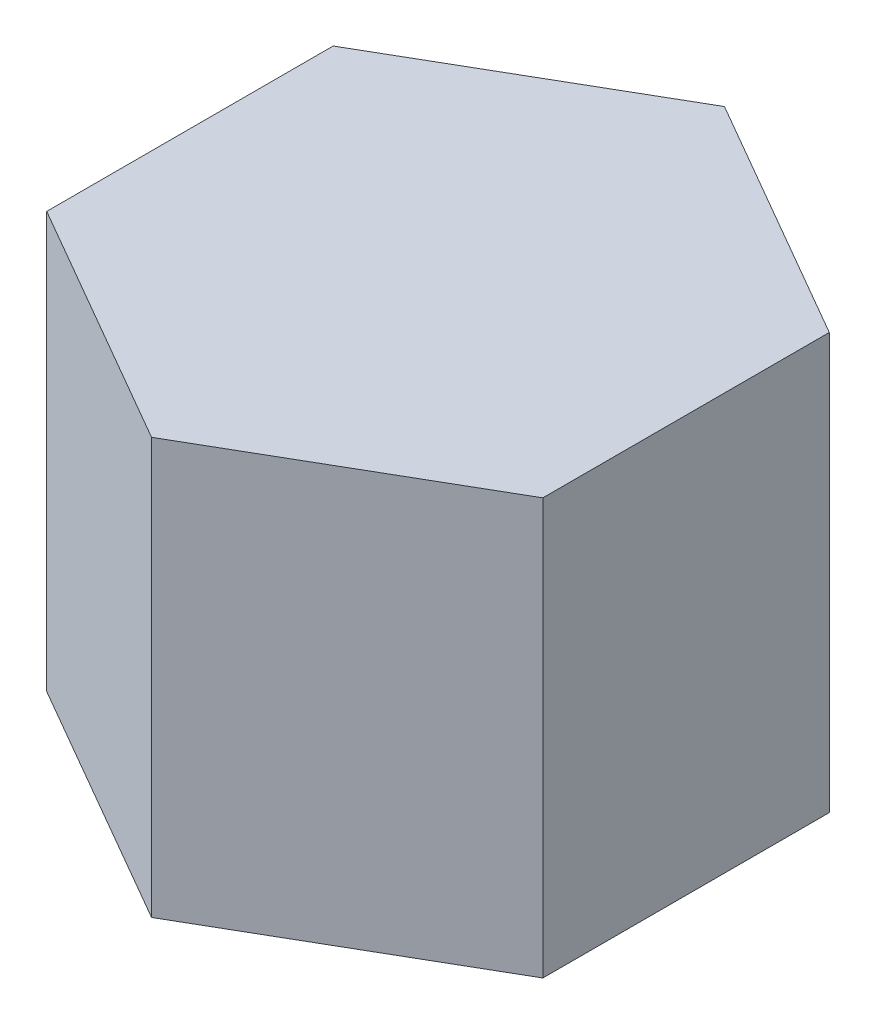
ISO-10303-21;
HEADER;
FILE_DESCRIPTION(('STEP AP214'),'2;1');
FILE_NAME('part.step','',(''),(''),'','','');
FILE_SCHEMA(('AUTOMOTIVE_DESIGN { 1 0 10303 214 1 1 1 1 }'));
ENDSEC;
DATA;
#1=APPLICATION_CONTEXT('core data for automotive mechanical design processes');
#2=APPLICATION_PROTOCOL_DEFINITION('international standard','automotive_design',2000,#1);
#3=PRODUCT_CONTEXT('',#1,'mechanical');
#4=PRODUCT('Part','Part','',(#3));
#5=PRODUCT_RELATED_PRODUCT_CATEGORY('part','',(#4));
#6=PRODUCT_DEFINITION_FORMATION('','',#4);
#7=PRODUCT_DEFINITION_CONTEXT('part definition',#1,'design');
#8=PRODUCT_DEFINITION('design','',#6,#7);
#9=PRODUCT_DEFINITION_SHAPE('','',#8);
#10=(LENGTH_UNIT() NAMED_UNIT(*) SI_UNIT(.MILLI.,.METRE.));
#11=(NAMED_UNIT(*) PLANE_ANGLE_UNIT() SI_UNIT($,.RADIAN.));
#12=(NAMED_UNIT(*) SI_UNIT($,.STERADIAN.) SOLID_ANGLE_UNIT());
#13=UNCERTAINTY_MEASURE_WITH_UNIT(LENGTH_MEASURE(1.E-05),#10,'distance_accuracy_value','');
#14=(GEOMETRIC_REPRESENTATION_CONTEXT(3) GLOBAL_UNCERTAINTY_ASSIGNED_CONTEXT((#13)) GLOBAL_UNIT_ASSIGNED_CONTEXT((#10,
#11,#12)) REPRESENTATION_CONTEXT('',''));
#15=CARTESIAN_POINT('',(0.,0.,0.));
#16=DIRECTION('',(0.,0.,1.));
#17=DIRECTION('',(1.,0.,0.));
#18=AXIS2_PLACEMENT_3D('',#15,#16,#17);
#19=CARTESIAN_POINT('',(209.642660308706,-148.537700895744,294.971072835632));
#20=DIRECTION('',(-0.499999999999909,0.,-0.866025403784491));
#21=DIRECTION('',(-0.866025403784491,0.,0.499999999999909));
#22=AXIS2_PLACEMENT_3D('',#19,#20,#21);
#23=PLANE('',#22);
#24=CARTESIAN_POINT('',(209.339551417381,-149.045793579175,295.146072835632));
#25=DIRECTION('',(0.866025403784491,0.,-0.499999999999909));
#26=VECTOR('',#25,1.);
#27=LINE('',#24,#26);
#28=CARTESIAN_POINT('',(209.339551417382,-149.045793579175,295.146072835632));
#29=VERTEX_POINT('',#28);
#30=CARTESIAN_POINT('',(209.642660308706,-149.045793579175,294.971072835632));
#31=VERTEX_POINT('',#30);
#32=EDGE_CURVE('E170',#29,#31,#27,.T.);
#33=ORIENTED_EDGE('',*,*,#32,.T.);
#34=CARTESIAN_POINT('',(209.642660308706,-148.537700895744,294.971072835632));
#35=DIRECTION('',(0.,-1.,0.));
#36=VECTOR('',#35,1.);
#37=LINE('',#34,#36);
#38=CARTESIAN_POINT('',(209.642660308706,-148.537700895744,294.971072835632));
#39=VERTEX_POINT('',#38);
#40=EDGE_CURVE('E35',#39,#31,#37,.T.);
#41=ORIENTED_EDGE('',*,*,#40,.F.);
#42=CARTESIAN_POINT('',(209.339551417381,-148.537700895744,295.146072835632));
#43=DIRECTION('',(0.866025403784491,0.,-0.499999999999909));
#44=VECTOR('',#43,1.);
#45=LINE('',#42,#44);
#46=CARTESIAN_POINT('',(209.339551417382,-148.537700895744,295.146072835632));
#47=VERTEX_POINT('',#46);
#48=EDGE_CURVE('E159',#47,#39,#45,.T.);
#49=ORIENTED_EDGE('',*,*,#48,.F.);
#50=CARTESIAN_POINT('',(209.339551417381,-148.537700895744,295.146072835632));
#51=DIRECTION('',(0.,-1.,0.));
#52=VECTOR('',#51,1.);
#53=LINE('',#50,#52);
#54=EDGE_CURVE('E10',#47,#29,#53,.T.);
#55=ORIENTED_EDGE('',*,*,#54,.T.);
#56=EDGE_LOOP('',(#33,#41,#49,#55));
#57=FACE_BOUND('',#56,.T.);
#58=ADVANCED_FACE('F16',(#57),#23,.F.);
#59=CARTESIAN_POINT('',(209.339551417382,-148.537700895744,295.146072835632));
#60=DIRECTION('',(0.500000000000062,0.,-0.866025403784403));
#61=DIRECTION('',(-0.866025403784403,0.,-0.500000000000062));
#62=AXIS2_PLACEMENT_3D('',#59,#60,#61);
#63=PLANE('',#62);
#64=CARTESIAN_POINT('',(209.036442526057,-149.045793579175,294.971072835632));
#65=DIRECTION('',(0.866025403784403,0.,0.500000000000062));
#66=VECTOR('',#65,1.);
#67=LINE('',#64,#66);
#68=CARTESIAN_POINT('',(209.036442526057,-149.045793579175,294.971072835632));
#69=VERTEX_POINT('',#68);
#70=EDGE_CURVE('E167',#69,#29,#67,.T.);
#71=ORIENTED_EDGE('',*,*,#70,.T.);
#72=ORIENTED_EDGE('',*,*,#54,.F.);
#73=CARTESIAN_POINT('',(209.036442526057,-148.537700895744,294.971072835632));
#74=DIRECTION('',(0.866025403784403,0.,0.500000000000062));
#75=VECTOR('',#74,1.);
#76=LINE('',#73,#75);
#77=CARTESIAN_POINT('',(209.036442526057,-148.537700895744,294.971072835632));
#78=VERTEX_POINT('',#77);
#79=EDGE_CURVE('E156',#78,#47,#76,.T.);
#80=ORIENTED_EDGE('',*,*,#79,.F.);
#81=CARTESIAN_POINT('',(209.036442526057,-148.537700895744,294.971072835632));
#82=DIRECTION('',(0.,-1.,0.));
#83=VECTOR('',#82,1.);
#84=LINE('',#81,#83);
#85=EDGE_CURVE('E27',#78,#69,#84,.T.);
#86=ORIENTED_EDGE('',*,*,#85,.T.);
#87=EDGE_LOOP('',(#71,#72,#80,#86));
#88=FACE_BOUND('',#87,.T.);
#89=ADVANCED_FACE('F189',(#88),#63,.F.);
#90=CARTESIAN_POINT('',(209.036442526057,-148.537700895744,290.831971220494));
#91=DIRECTION('',(1.,0.,0.));
#92=DIRECTION('',(0.,1.,0.));
#93=AXIS2_PLACEMENT_3D('',#90,#91,#92);
#94=PLANE('',#93);
#95=CARTESIAN_POINT('',(209.036442526057,-149.045793579175,294.621072835632));
#96=DIRECTION('',(0.,0.,1.));
#97=VECTOR('',#96,1.);
#98=LINE('',#95,#97);
#99=CARTESIAN_POINT('',(209.036442526057,-149.045793579175,294.621072835632));
#100=VERTEX_POINT('',#99);
#101=EDGE_CURVE('E163',#100,#69,#98,.T.);
#102=ORIENTED_EDGE('',*,*,#101,.T.);
#103=ORIENTED_EDGE('',*,*,#85,.F.);
#104=CARTESIAN_POINT('',(209.036442526057,-148.537700895744,294.621072835632));
#105=DIRECTION('',(0.,0.,1.));
#106=VECTOR('',#105,1.);
#107=LINE('',#104,#106);
#108=CARTESIAN_POINT('',(209.036442526057,-148.537700895744,294.621072835632));
#109=VERTEX_POINT('',#108);
#110=EDGE_CURVE('E106',#109,#78,#107,.T.);
#111=ORIENTED_EDGE('',*,*,#110,.F.);
#112=CARTESIAN_POINT('',(209.036442526057,-148.537700895744,294.621072835632));
#113=DIRECTION('',(0.,-1.,0.));
#114=VECTOR('',#113,1.);
#115=LINE('',#112,#114);
#116=EDGE_CURVE('E94',#109,#100,#115,.T.);
#117=ORIENTED_EDGE('',*,*,#116,.T.);
#118=EDGE_LOOP('',(#102,#103,#111,#117));
#119=FACE_BOUND('',#118,.T.);
#120=ADVANCED_FACE('F198',(#119),#94,.F.);
#121=CARTESIAN_POINT('',(209.036442526057,-148.537700895744,294.621072835632));
#122=DIRECTION('',(0.499999999999978,0.,0.866025403784452));
#123=DIRECTION('',(0.866025403784452,0.,-0.499999999999978));
#124=AXIS2_PLACEMENT_3D('',#121,#122,#123);
#125=PLANE('',#124);
#126=CARTESIAN_POINT('',(209.339551417382,-149.045793579175,294.446072835632));
#127=DIRECTION('',(-0.866025403784452,0.,0.499999999999978));
#128=VECTOR('',#127,1.);
#129=LINE('',#126,#128);
#130=CARTESIAN_POINT('',(209.339551417382,-149.045793579175,294.446072835632));
#131=VERTEX_POINT('',#130);
#132=EDGE_CURVE('E162',#131,#100,#129,.T.);
#133=ORIENTED_EDGE('',*,*,#132,.T.);
#134=ORIENTED_EDGE('',*,*,#116,.F.);
#135=CARTESIAN_POINT('',(209.339551417382,-148.537700895744,294.446072835632));
#136=DIRECTION('',(-0.866025403784452,0.,0.499999999999978));
#137=VECTOR('',#136,1.);
#138=LINE('',#135,#137);
#139=CARTESIAN_POINT('',(209.339551417382,-148.537700895744,294.446072835632));
#140=VERTEX_POINT('',#139);
#141=EDGE_CURVE('E98',#140,#109,#138,.T.);
#142=ORIENTED_EDGE('',*,*,#141,.F.);
#143=CARTESIAN_POINT('',(209.339551417382,-148.537700895744,294.446072835632));
#144=DIRECTION('',(0.,-1.,0.));
#145=VECTOR('',#144,1.);
#146=LINE('',#143,#145);
#147=EDGE_CURVE('E79',#140,#131,#146,.T.);
#148=ORIENTED_EDGE('',*,*,#147,.T.);
#149=EDGE_LOOP('',(#133,#134,#142,#148));
#150=FACE_BOUND('',#149,.T.);
#151=ADVANCED_FACE('F100',(#150),#125,.F.);
#152=CARTESIAN_POINT('',(209.339551417382,-148.537700895744,294.446072835632));
#153=DIRECTION('',(-0.500000000000062,0.,0.866025403784403));
#154=DIRECTION('',(0.866025403784403,0.,0.500000000000062));
#155=AXIS2_PLACEMENT_3D('',#152,#153,#154);
#156=PLANE('',#155);
#157=CARTESIAN_POINT('',(209.642660308706,-149.045793579175,294.621072835632));
#158=DIRECTION('',(-0.866025403784403,0.,-0.500000000000062));
#159=VECTOR('',#158,1.);
#160=LINE('',#157,#159);
#161=CARTESIAN_POINT('',(209.642660308706,-149.045793579175,294.621072835632));
#162=VERTEX_POINT('',#161);
#163=EDGE_CURVE('E88',#162,#131,#160,.T.);
#164=ORIENTED_EDGE('',*,*,#163,.T.);
#165=ORIENTED_EDGE('',*,*,#147,.F.);
#166=CARTESIAN_POINT('',(209.642660308706,-148.537700895744,294.621072835632));
#167=DIRECTION('',(-0.866025403784403,0.,-0.500000000000062));
#168=VECTOR('',#167,1.);
#169=LINE('',#166,#168);
#170=CARTESIAN_POINT('',(209.642660308706,-148.537700895744,294.621072835632));
#171=VERTEX_POINT('',#170);
#172=EDGE_CURVE('E84',#171,#140,#169,.T.);
#173=ORIENTED_EDGE('',*,*,#172,.F.);
#174=CARTESIAN_POINT('',(209.642660308706,-148.537700895744,294.621072835632));
#175=DIRECTION('',(0.,-1.,0.));
#176=VECTOR('',#175,1.);
#177=LINE('',#174,#176);
#178=EDGE_CURVE('E58',#171,#162,#177,.T.);
#179=ORIENTED_EDGE('',*,*,#178,.T.);
#180=EDGE_LOOP('',(#164,#165,#173,#179));
#181=FACE_BOUND('',#180,.T.);
#182=ADVANCED_FACE('F82',(#181),#156,.F.);
#183=CARTESIAN_POINT('',(209.642660308706,-148.537700895744,290.831971220494));
#184=DIRECTION('',(-1.,0.,0.));
#185=DIRECTION('',(0.,-1.,0.));
#186=AXIS2_PLACEMENT_3D('',#183,#184,#185);
#187=PLANE('',#186);
#188=CARTESIAN_POINT('',(209.642660308706,-149.045793579175,294.971072835632));
#189=DIRECTION('',(0.,0.,-1.));
#190=VECTOR('',#189,1.);
#191=LINE('',#188,#190);
#192=EDGE_CURVE('E160',#31,#162,#191,.T.);
#193=ORIENTED_EDGE('',*,*,#192,.T.);
#194=ORIENTED_EDGE('',*,*,#178,.F.);
#195=CARTESIAN_POINT('',(209.642660308706,-148.537700895744,294.971072835632));
#196=DIRECTION('',(0.,0.,-1.));
#197=VECTOR('',#196,1.);
#198=LINE('',#195,#197);
#199=EDGE_CURVE('E112',#39,#171,#198,.T.);
#200=ORIENTED_EDGE('',*,*,#199,.F.);
#201=ORIENTED_EDGE('',*,*,#40,.T.);
#202=EDGE_LOOP('',(#193,#194,#200,#201));
#203=FACE_BOUND('',#202,.T.);
#204=ADVANCED_FACE('F131',(#203),#187,.F.);
#205=CARTESIAN_POINT('',(206.339551417382,-148.537700895744,290.831971220494));
#206=DIRECTION('',(0.,-1.,0.));
#207=DIRECTION('',(1.,0.,0.));
#208=AXIS2_PLACEMENT_3D('',#205,#206,#207);
#209=PLANE('',#208);
#210=ORIENTED_EDGE('',*,*,#48,.T.);
#211=ORIENTED_EDGE('',*,*,#199,.T.);
#212=ORIENTED_EDGE('',*,*,#172,.T.);
#213=ORIENTED_EDGE('',*,*,#141,.T.);
#214=ORIENTED_EDGE('',*,*,#110,.T.);
#215=ORIENTED_EDGE('',*,*,#79,.T.);
#216=EDGE_LOOP('',(#210,#211,#212,#213,#214,#215));
#217=FACE_BOUND('',#216,.T.);
#218=ADVANCED_FACE('F111',(#217),#209,.F.);
#219=CARTESIAN_POINT('',(206.339551417382,-149.045793579175,290.831971220494));
#220=DIRECTION('',(0.,-1.,0.));
#221=DIRECTION('',(1.,0.,0.));
#222=AXIS2_PLACEMENT_3D('',#219,#220,#221);
#223=PLANE('',#222);
#224=ORIENTED_EDGE('',*,*,#32,.F.);
#225=ORIENTED_EDGE('',*,*,#70,.F.);
#226=ORIENTED_EDGE('',*,*,#101,.F.);
#227=ORIENTED_EDGE('',*,*,#132,.F.);
#228=ORIENTED_EDGE('',*,*,#163,.F.);
#229=ORIENTED_EDGE('',*,*,#192,.F.);
#230=EDGE_LOOP('',(#224,#225,#226,#227,#228,#229));
#231=FACE_BOUND('',#230,.T.);
#232=ADVANCED_FACE('F130',(#231),#223,.T.);
#233=CLOSED_SHELL('',(#58,#89,#120,#151,#182,#204,#218,#232));
#234=MANIFOLD_SOLID_BREP('B1',#233);
#235=ADVANCED_BREP_SHAPE_REPRESENTATION('',(#18,#234),#14);
#236=SHAPE_DEFINITION_REPRESENTATION(#9,#235);
ENDSEC;
END-ISO-10303-21;
